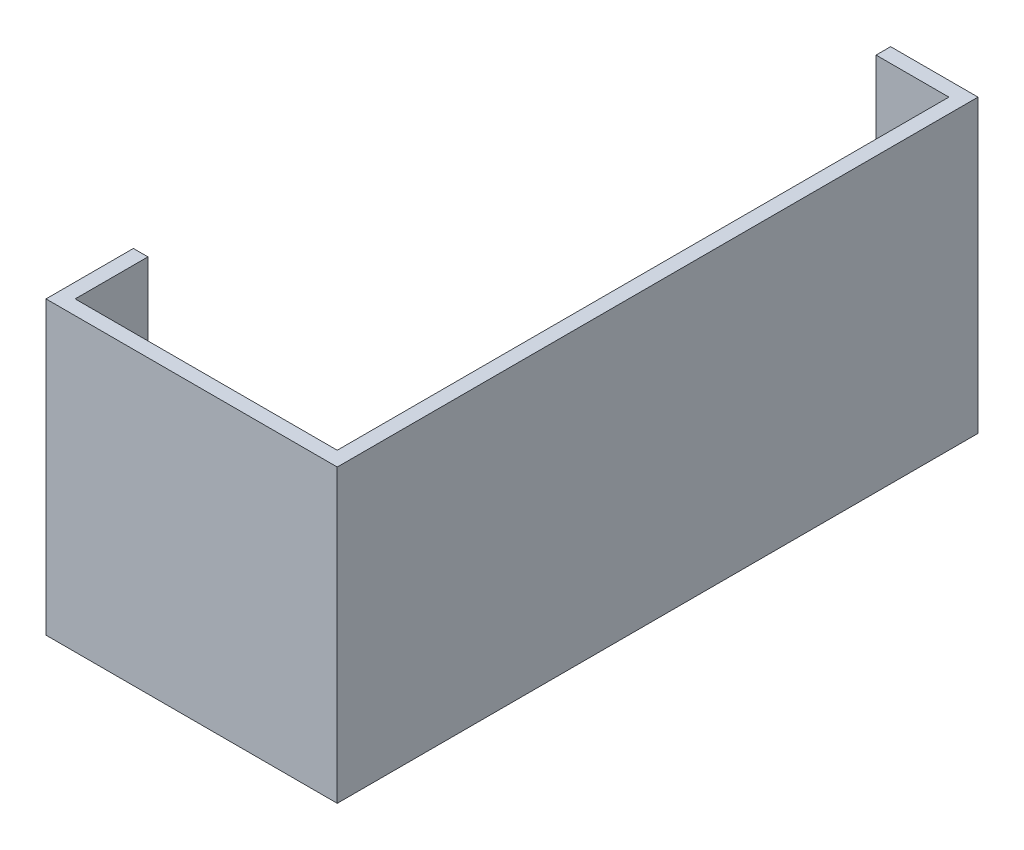
ISO-10303-21;
HEADER;
FILE_DESCRIPTION(('STEP AP214'),'2;1');
FILE_NAME('part.step','',(''),(''),'','','');
FILE_SCHEMA(('AUTOMOTIVE_DESIGN { 1 0 10303 214 1 1 1 1 }'));
ENDSEC;
DATA;
#1=APPLICATION_CONTEXT('core data for automotive mechanical design processes');
#2=APPLICATION_PROTOCOL_DEFINITION('international standard','automotive_design',2000,#1);
#3=PRODUCT_CONTEXT('',#1,'mechanical');
#4=PRODUCT('Part','Part','',(#3));
#5=PRODUCT_RELATED_PRODUCT_CATEGORY('part','',(#4));
#6=PRODUCT_DEFINITION_FORMATION('','',#4);
#7=PRODUCT_DEFINITION_CONTEXT('part definition',#1,'design');
#8=PRODUCT_DEFINITION('design','',#6,#7);
#9=PRODUCT_DEFINITION_SHAPE('','',#8);
#10=(LENGTH_UNIT() NAMED_UNIT(*) SI_UNIT(.MILLI.,.METRE.));
#11=(NAMED_UNIT(*) PLANE_ANGLE_UNIT() SI_UNIT($,.RADIAN.));
#12=(NAMED_UNIT(*) SI_UNIT($,.STERADIAN.) SOLID_ANGLE_UNIT());
#13=UNCERTAINTY_MEASURE_WITH_UNIT(LENGTH_MEASURE(1.E-05),#10,'distance_accuracy_value','');
#14=(GEOMETRIC_REPRESENTATION_CONTEXT(3) GLOBAL_UNCERTAINTY_ASSIGNED_CONTEXT((#13)) GLOBAL_UNIT_ASSIGNED_CONTEXT((#10,
#11,#12)) REPRESENTATION_CONTEXT('',''));
#15=CARTESIAN_POINT('',(0.,0.,0.));
#16=DIRECTION('',(0.,0.,1.));
#17=DIRECTION('',(1.,0.,0.));
#18=AXIS2_PLACEMENT_3D('',#15,#16,#17);
#19=CARTESIAN_POINT('',(-5.,100.,-215.));
#20=DIRECTION('',(0.,0.,-1.));
#21=DIRECTION('',(-1.,0.,0.));
#22=AXIS2_PLACEMENT_3D('',#19,#20,#21);
#23=PLANE('',#22);
#24=DIRECTION('',(1.,0.,0.));
#25=VECTOR('',#24,1.);
#26=CARTESIAN_POINT('',(-30.,3.,-215.));
#27=LINE('',#26,#25);
#28=CARTESIAN_POINT('',(-30.,3.,-215.));
#29=VERTEX_POINT('',#28);
#30=CARTESIAN_POINT('',(-5.,3.,-215.));
#31=VERTEX_POINT('',#30);
#32=EDGE_CURVE('E57',#29,#31,#27,.T.);
#33=ORIENTED_EDGE('',*,*,#32,.T.);
#34=DIRECTION('',(0.,-1.,0.));
#35=VECTOR('',#34,1.);
#36=CARTESIAN_POINT('',(-5.,100.,-215.));
#37=LINE('',#36,#35);
#38=CARTESIAN_POINT('',(-5.,100.,-215.));
#39=VERTEX_POINT('',#38);
#40=EDGE_CURVE('E169',#39,#31,#37,.T.);
#41=ORIENTED_EDGE('',*,*,#40,.F.);
#42=DIRECTION('',(1.,0.,0.));
#43=VECTOR('',#42,1.);
#44=CARTESIAN_POINT('',(-5.,100.,-215.));
#45=LINE('',#44,#43);
#46=CARTESIAN_POINT('',(-30.,100.,-215.));
#47=VERTEX_POINT('',#46);
#48=EDGE_CURVE('E194',#47,#39,#45,.T.);
#49=ORIENTED_EDGE('',*,*,#48,.F.);
#50=DIRECTION('',(0.,-1.,0.));
#51=VECTOR('',#50,1.);
#52=CARTESIAN_POINT('',(-30.,100.,-215.));
#53=LINE('',#52,#51);
#54=EDGE_CURVE('E171',#47,#29,#53,.T.);
#55=ORIENTED_EDGE('',*,*,#54,.T.);
#56=EDGE_LOOP('',(#33,#41,#49,#55));
#57=FACE_BOUND('',#56,.T.);
#58=ADVANCED_FACE('F35',(#57),#23,.F.);
#59=CARTESIAN_POINT('',(-5.,100.,-5.));
#60=DIRECTION('',(1.,0.,0.));
#61=DIRECTION('',(0.,0.,-1.));
#62=AXIS2_PLACEMENT_3D('',#59,#60,#61);
#63=PLANE('',#62);
#64=DIRECTION('',(0.,0.,1.));
#65=VECTOR('',#64,1.);
#66=CARTESIAN_POINT('',(-5.,3.,-215.));
#67=LINE('',#66,#65);
#68=CARTESIAN_POINT('',(-5.,3.,-5.));
#69=VERTEX_POINT('',#68);
#70=EDGE_CURVE('E229',#31,#69,#67,.T.);
#71=ORIENTED_EDGE('',*,*,#70,.T.);
#72=DIRECTION('',(0.,-1.,0.));
#73=VECTOR('',#72,1.);
#74=CARTESIAN_POINT('',(-5.,100.,-5.));
#75=LINE('',#74,#73);
#76=CARTESIAN_POINT('',(-5.,100.,-5.));
#77=VERTEX_POINT('',#76);
#78=EDGE_CURVE('E166',#77,#69,#75,.T.);
#79=ORIENTED_EDGE('',*,*,#78,.F.);
#80=DIRECTION('',(0.,0.,1.));
#81=VECTOR('',#80,1.);
#82=CARTESIAN_POINT('',(-5.,100.,-5.));
#83=LINE('',#82,#81);
#84=EDGE_CURVE('E197',#39,#77,#83,.T.);
#85=ORIENTED_EDGE('',*,*,#84,.F.);
#86=ORIENTED_EDGE('',*,*,#40,.T.);
#87=EDGE_LOOP('',(#71,#79,#85,#86));
#88=FACE_BOUND('',#87,.T.);
#89=ADVANCED_FACE('F237',(#88),#63,.F.);
#90=CARTESIAN_POINT('',(-95.,100.,-5.));
#91=DIRECTION('',(0.,0.,1.));
#92=DIRECTION('',(1.,0.,0.));
#93=AXIS2_PLACEMENT_3D('',#90,#91,#92);
#94=PLANE('',#93);
#95=DIRECTION('',(-1.,0.,0.));
#96=VECTOR('',#95,1.);
#97=CARTESIAN_POINT('',(-5.,3.,-5.));
#98=LINE('',#97,#96);
#99=CARTESIAN_POINT('',(-95.,3.,-5.));
#100=VERTEX_POINT('',#99);
#101=EDGE_CURVE('E228',#69,#100,#98,.T.);
#102=ORIENTED_EDGE('',*,*,#101,.T.);
#103=DIRECTION('',(0.,-1.,0.));
#104=VECTOR('',#103,1.);
#105=CARTESIAN_POINT('',(-95.,100.,-5.));
#106=LINE('',#105,#104);
#107=CARTESIAN_POINT('',(-95.,100.,-5.));
#108=VERTEX_POINT('',#107);
#109=EDGE_CURVE('E163',#108,#100,#106,.T.);
#110=ORIENTED_EDGE('',*,*,#109,.F.);
#111=DIRECTION('',(-1.,0.,0.));
#112=VECTOR('',#111,1.);
#113=CARTESIAN_POINT('',(-95.,100.,-5.));
#114=LINE('',#113,#112);
#115=EDGE_CURVE('E203',#77,#108,#114,.T.);
#116=ORIENTED_EDGE('',*,*,#115,.F.);
#117=ORIENTED_EDGE('',*,*,#78,.T.);
#118=EDGE_LOOP('',(#102,#110,#116,#117));
#119=FACE_BOUND('',#118,.T.);
#120=ADVANCED_FACE('F240',(#119),#94,.F.);
#121=CARTESIAN_POINT('',(-95.,100.,-5.));
#122=DIRECTION('',(-1.,0.,0.));
#123=DIRECTION('',(0.,0.,1.));
#124=AXIS2_PLACEMENT_3D('',#121,#122,#123);
#125=PLANE('',#124);
#126=DIRECTION('',(0.,0.,-1.));
#127=VECTOR('',#126,1.);
#128=CARTESIAN_POINT('',(-95.,3.,-5.));
#129=LINE('',#128,#127);
#130=CARTESIAN_POINT('',(-95.,3.,-30.));
#131=VERTEX_POINT('',#130);
#132=EDGE_CURVE('E212',#100,#131,#129,.T.);
#133=ORIENTED_EDGE('',*,*,#132,.T.);
#134=DIRECTION('',(0.,-1.,0.));
#135=VECTOR('',#134,1.);
#136=CARTESIAN_POINT('',(-95.,100.,-30.));
#137=LINE('',#136,#135);
#138=CARTESIAN_POINT('',(-95.,100.,-30.));
#139=VERTEX_POINT('',#138);
#140=EDGE_CURVE('E160',#139,#131,#137,.T.);
#141=ORIENTED_EDGE('',*,*,#140,.F.);
#142=DIRECTION('',(0.,0.,-1.));
#143=VECTOR('',#142,1.);
#144=CARTESIAN_POINT('',(-95.,100.,-5.));
#145=LINE('',#144,#143);
#146=EDGE_CURVE('E204',#108,#139,#145,.T.);
#147=ORIENTED_EDGE('',*,*,#146,.F.);
#148=ORIENTED_EDGE('',*,*,#109,.T.);
#149=EDGE_LOOP('',(#133,#141,#147,#148));
#150=FACE_BOUND('',#149,.T.);
#151=ADVANCED_FACE('F210',(#150),#125,.F.);
#152=CARTESIAN_POINT('',(-100.,100.,0.));
#153=DIRECTION('',(1.,0.,0.));
#154=DIRECTION('',(0.,0.,-1.));
#155=AXIS2_PLACEMENT_3D('',#152,#153,#154);
#156=PLANE('',#155);
#157=DIRECTION('',(0.,0.,1.));
#158=VECTOR('',#157,1.);
#159=CARTESIAN_POINT('',(-100.,0.,0.));
#160=LINE('',#159,#158);
#161=CARTESIAN_POINT('',(-100.,0.,-30.));
#162=VERTEX_POINT('',#161);
#163=CARTESIAN_POINT('',(-100.,0.,0.));
#164=VERTEX_POINT('',#163);
#165=EDGE_CURVE('E140',#162,#164,#160,.T.);
#166=ORIENTED_EDGE('',*,*,#165,.T.);
#167=DIRECTION('',(0.,-1.,0.));
#168=VECTOR('',#167,1.);
#169=CARTESIAN_POINT('',(-100.,100.,0.));
#170=LINE('',#169,#168);
#171=CARTESIAN_POINT('',(-100.,100.,0.));
#172=VERTEX_POINT('',#171);
#173=EDGE_CURVE('E11',#172,#164,#170,.T.);
#174=ORIENTED_EDGE('',*,*,#173,.F.);
#175=DIRECTION('',(0.,0.,1.));
#176=VECTOR('',#175,1.);
#177=CARTESIAN_POINT('',(-100.,100.,0.));
#178=LINE('',#177,#176);
#179=CARTESIAN_POINT('',(-100.,100.,-30.));
#180=VERTEX_POINT('',#179);
#181=EDGE_CURVE('E128',#180,#172,#178,.T.);
#182=ORIENTED_EDGE('',*,*,#181,.F.);
#183=DIRECTION('',(0.,-1.,0.));
#184=VECTOR('',#183,1.);
#185=CARTESIAN_POINT('',(-100.,100.,-30.));
#186=LINE('',#185,#184);
#187=EDGE_CURVE('E141',#180,#162,#186,.T.);
#188=ORIENTED_EDGE('',*,*,#187,.T.);
#189=EDGE_LOOP('',(#166,#174,#182,#188));
#190=FACE_BOUND('',#189,.T.);
#191=ADVANCED_FACE('F37',(#190),#156,.F.);
#192=CARTESIAN_POINT('',(-100.,100.,0.));
#193=DIRECTION('',(0.,0.,-1.));
#194=DIRECTION('',(-1.,0.,0.));
#195=AXIS2_PLACEMENT_3D('',#192,#193,#194);
#196=PLANE('',#195);
#197=DIRECTION('',(1.,0.,0.));
#198=VECTOR('',#197,1.);
#199=CARTESIAN_POINT('',(-100.,0.,0.));
#200=LINE('',#199,#198);
#201=CARTESIAN_POINT('',(0.,0.,0.));
#202=VERTEX_POINT('',#201);
#203=EDGE_CURVE('E144',#164,#202,#200,.T.);
#204=ORIENTED_EDGE('',*,*,#203,.T.);
#205=DIRECTION('',(0.,-1.,0.));
#206=VECTOR('',#205,1.);
#207=CARTESIAN_POINT('',(0.,100.,0.));
#208=LINE('',#207,#206);
#209=CARTESIAN_POINT('',(0.,100.,0.));
#210=VERTEX_POINT('',#209);
#211=EDGE_CURVE('E43',#210,#202,#208,.T.);
#212=ORIENTED_EDGE('',*,*,#211,.F.);
#213=DIRECTION('',(1.,0.,0.));
#214=VECTOR('',#213,1.);
#215=CARTESIAN_POINT('',(-100.,100.,0.));
#216=LINE('',#215,#214);
#217=EDGE_CURVE('E119',#172,#210,#216,.T.);
#218=ORIENTED_EDGE('',*,*,#217,.F.);
#219=ORIENTED_EDGE('',*,*,#173,.T.);
#220=EDGE_LOOP('',(#204,#212,#218,#219));
#221=FACE_BOUND('',#220,.T.);
#222=ADVANCED_FACE('F121',(#221),#196,.F.);
#223=CARTESIAN_POINT('',(0.,100.,0.));
#224=DIRECTION('',(-1.,0.,0.));
#225=DIRECTION('',(0.,0.,1.));
#226=AXIS2_PLACEMENT_3D('',#223,#224,#225);
#227=PLANE('',#226);
#228=DIRECTION('',(0.,0.,-1.));
#229=VECTOR('',#228,1.);
#230=CARTESIAN_POINT('',(0.,0.,0.));
#231=LINE('',#230,#229);
#232=CARTESIAN_POINT('',(0.,0.,-220.));
#233=VERTEX_POINT('',#232);
#234=EDGE_CURVE('E147',#202,#233,#231,.T.);
#235=ORIENTED_EDGE('',*,*,#234,.T.);
#236=DIRECTION('',(0.,-1.,0.));
#237=VECTOR('',#236,1.);
#238=CARTESIAN_POINT('',(0.,100.,-220.));
#239=LINE('',#238,#237);
#240=CARTESIAN_POINT('',(0.,100.,-220.));
#241=VERTEX_POINT('',#240);
#242=EDGE_CURVE('E176',#241,#233,#239,.T.);
#243=ORIENTED_EDGE('',*,*,#242,.F.);
#244=DIRECTION('',(0.,0.,-1.));
#245=VECTOR('',#244,1.);
#246=CARTESIAN_POINT('',(0.,100.,0.));
#247=LINE('',#246,#245);
#248=EDGE_CURVE('E127',#210,#241,#247,.T.);
#249=ORIENTED_EDGE('',*,*,#248,.F.);
#250=ORIENTED_EDGE('',*,*,#211,.T.);
#251=EDGE_LOOP('',(#235,#243,#249,#250));
#252=FACE_BOUND('',#251,.T.);
#253=ADVANCED_FACE('F180',(#252),#227,.F.);
#254=CARTESIAN_POINT('',(0.,100.,-220.));
#255=DIRECTION('',(0.,0.,1.));
#256=DIRECTION('',(1.,0.,0.));
#257=AXIS2_PLACEMENT_3D('',#254,#255,#256);
#258=PLANE('',#257);
#259=DIRECTION('',(-1.,0.,0.));
#260=VECTOR('',#259,1.);
#261=CARTESIAN_POINT('',(0.,0.,-220.));
#262=LINE('',#261,#260);
#263=CARTESIAN_POINT('',(-30.,0.,-220.));
#264=VERTEX_POINT('',#263);
#265=EDGE_CURVE('E154',#233,#264,#262,.T.);
#266=ORIENTED_EDGE('',*,*,#265,.T.);
#267=DIRECTION('',(0.,-1.,0.));
#268=VECTOR('',#267,1.);
#269=CARTESIAN_POINT('',(-30.,100.,-220.));
#270=LINE('',#269,#268);
#271=CARTESIAN_POINT('',(-30.,100.,-220.));
#272=VERTEX_POINT('',#271);
#273=EDGE_CURVE('E173',#272,#264,#270,.T.);
#274=ORIENTED_EDGE('',*,*,#273,.F.);
#275=DIRECTION('',(-1.,0.,0.));
#276=VECTOR('',#275,1.);
#277=CARTESIAN_POINT('',(0.,100.,-220.));
#278=LINE('',#277,#276);
#279=EDGE_CURVE('E195',#241,#272,#278,.T.);
#280=ORIENTED_EDGE('',*,*,#279,.F.);
#281=ORIENTED_EDGE('',*,*,#242,.T.);
#282=EDGE_LOOP('',(#266,#274,#280,#281));
#283=FACE_BOUND('',#282,.T.);
#284=ADVANCED_FACE('F188',(#283),#258,.F.);
#285=CARTESIAN_POINT('',(-30.,100.,-220.));
#286=DIRECTION('',(1.,0.,0.));
#287=DIRECTION('',(0.,0.,-1.));
#288=AXIS2_PLACEMENT_3D('',#285,#286,#287);
#289=PLANE('',#288);
#290=DIRECTION('',(0.,0.,1.));
#291=VECTOR('',#290,1.);
#292=CARTESIAN_POINT('',(-30.,0.,-220.));
#293=LINE('',#292,#291);
#294=CARTESIAN_POINT('',(-30.,0.,-215.));
#295=VERTEX_POINT('',#294);
#296=EDGE_CURVE('E156',#264,#295,#293,.T.);
#297=ORIENTED_EDGE('',*,*,#296,.T.);
#298=DIRECTION('',(0.,-1.,0.));
#299=VECTOR('',#298,1.);
#300=CARTESIAN_POINT('',(-30.,3.,-215.));
#301=LINE('',#300,#299);
#302=EDGE_CURVE('E50',#29,#295,#301,.T.);
#303=ORIENTED_EDGE('',*,*,#302,.F.);
#304=ORIENTED_EDGE('',*,*,#54,.F.);
#305=DIRECTION('',(0.,0.,1.));
#306=VECTOR('',#305,1.);
#307=CARTESIAN_POINT('',(-30.,100.,-220.));
#308=LINE('',#307,#306);
#309=EDGE_CURVE('E192',#272,#47,#308,.T.);
#310=ORIENTED_EDGE('',*,*,#309,.F.);
#311=ORIENTED_EDGE('',*,*,#273,.T.);
#312=EDGE_LOOP('',(#297,#303,#304,#310,#311));
#313=FACE_BOUND('',#312,.T.);
#314=ADVANCED_FACE('F191',(#313),#289,.F.);
#315=CARTESIAN_POINT('',(-100.,100.,-30.));
#316=DIRECTION('',(0.,0.,1.));
#317=DIRECTION('',(1.,0.,0.));
#318=AXIS2_PLACEMENT_3D('',#315,#316,#317);
#319=PLANE('',#318);
#320=DIRECTION('',(-1.,0.,0.));
#321=VECTOR('',#320,1.);
#322=CARTESIAN_POINT('',(-100.,0.,-30.));
#323=LINE('',#322,#321);
#324=CARTESIAN_POINT('',(-95.,0.,-30.));
#325=VERTEX_POINT('',#324);
#326=EDGE_CURVE('E137',#325,#162,#323,.T.);
#327=ORIENTED_EDGE('',*,*,#326,.T.);
#328=ORIENTED_EDGE('',*,*,#187,.F.);
#329=DIRECTION('',(-1.,0.,0.));
#330=VECTOR('',#329,1.);
#331=CARTESIAN_POINT('',(-100.,100.,-30.));
#332=LINE('',#331,#330);
#333=EDGE_CURVE('E133',#139,#180,#332,.T.);
#334=ORIENTED_EDGE('',*,*,#333,.F.);
#335=ORIENTED_EDGE('',*,*,#140,.T.);
#336=DIRECTION('',(0.,-1.,0.));
#337=VECTOR('',#336,1.);
#338=CARTESIAN_POINT('',(-95.,3.,-30.));
#339=LINE('',#338,#337);
#340=EDGE_CURVE('E145',#131,#325,#339,.T.);
#341=ORIENTED_EDGE('',*,*,#340,.T.);
#342=EDGE_LOOP('',(#327,#328,#334,#335,#341));
#343=FACE_BOUND('',#342,.T.);
#344=ADVANCED_FACE('F215',(#343),#319,.F.);
#345=CARTESIAN_POINT('',(0.,100.,0.));
#346=DIRECTION('',(0.,-1.,0.));
#347=DIRECTION('',(0.,0.,-1.));
#348=AXIS2_PLACEMENT_3D('',#345,#346,#347);
#349=PLANE('',#348);
#350=ORIENTED_EDGE('',*,*,#181,.T.);
#351=ORIENTED_EDGE('',*,*,#217,.T.);
#352=ORIENTED_EDGE('',*,*,#248,.T.);
#353=ORIENTED_EDGE('',*,*,#279,.T.);
#354=ORIENTED_EDGE('',*,*,#309,.T.);
#355=ORIENTED_EDGE('',*,*,#48,.T.);
#356=ORIENTED_EDGE('',*,*,#84,.T.);
#357=ORIENTED_EDGE('',*,*,#115,.T.);
#358=ORIENTED_EDGE('',*,*,#146,.T.);
#359=ORIENTED_EDGE('',*,*,#333,.T.);
#360=EDGE_LOOP('',(#350,#351,#352,#353,#354,#355,#356,#357,#358,#359));
#361=FACE_BOUND('',#360,.T.);
#362=ADVANCED_FACE('F131',(#361),#349,.F.);
#363=CARTESIAN_POINT('',(0.,0.,0.));
#364=DIRECTION('',(0.,-1.,0.));
#365=DIRECTION('',(0.,0.,-1.));
#366=AXIS2_PLACEMENT_3D('',#363,#364,#365);
#367=PLANE('',#366);
#368=ORIENTED_EDGE('',*,*,#326,.F.);
#369=DIRECTION('',(0.33148599501256,0.,-0.943460139651132));
#370=VECTOR('',#369,1.);
#371=CARTESIAN_POINT('',(-95.,0.,-30.));
#372=LINE('',#371,#370);
#373=EDGE_CURVE('E217',#325,#295,#372,.T.);
#374=ORIENTED_EDGE('',*,*,#373,.T.);
#375=ORIENTED_EDGE('',*,*,#296,.F.);
#376=ORIENTED_EDGE('',*,*,#265,.F.);
#377=ORIENTED_EDGE('',*,*,#234,.F.);
#378=ORIENTED_EDGE('',*,*,#203,.F.);
#379=ORIENTED_EDGE('',*,*,#165,.F.);
#380=EDGE_LOOP('',(#368,#374,#375,#376,#377,#378,#379));
#381=FACE_BOUND('',#380,.T.);
#382=ADVANCED_FACE('F183',(#381),#367,.T.);
#383=CARTESIAN_POINT('',(-95.,3.,-30.));
#384=DIRECTION('',(-0.943460139651132,0.,-0.33148599501256));
#385=DIRECTION('',(-0.33148599501256,0.,0.943460139651132));
#386=AXIS2_PLACEMENT_3D('',#383,#384,#385);
#387=PLANE('',#386);
#388=ORIENTED_EDGE('',*,*,#373,.F.);
#389=ORIENTED_EDGE('',*,*,#340,.F.);
#390=DIRECTION('',(0.33148599501256,0.,-0.943460139651132));
#391=VECTOR('',#390,1.);
#392=CARTESIAN_POINT('',(-95.,3.,-30.));
#393=LINE('',#392,#391);
#394=EDGE_CURVE('E222',#131,#29,#393,.T.);
#395=ORIENTED_EDGE('',*,*,#394,.T.);
#396=ORIENTED_EDGE('',*,*,#302,.T.);
#397=EDGE_LOOP('',(#388,#389,#395,#396));
#398=FACE_BOUND('',#397,.T.);
#399=ADVANCED_FACE('F219',(#398),#387,.T.);
#400=CARTESIAN_POINT('',(0.,3.,0.));
#401=DIRECTION('',(0.,-1.,0.));
#402=DIRECTION('',(0.,0.,-1.));
#403=AXIS2_PLACEMENT_3D('',#400,#401,#402);
#404=PLANE('',#403);
#405=ORIENTED_EDGE('',*,*,#394,.F.);
#406=ORIENTED_EDGE('',*,*,#132,.F.);
#407=ORIENTED_EDGE('',*,*,#101,.F.);
#408=ORIENTED_EDGE('',*,*,#70,.F.);
#409=ORIENTED_EDGE('',*,*,#32,.F.);
#410=EDGE_LOOP('',(#405,#406,#407,#408,#409));
#411=FACE_BOUND('',#410,.T.);
#412=ADVANCED_FACE('F241',(#411),#404,.F.);
#413=CLOSED_SHELL('',(#58,#89,#120,#151,#191,#222,#253,#284,#314,#344,#362,#382,#399,#412));
#414=MANIFOLD_SOLID_BREP('B2',#413);
#415=ADVANCED_BREP_SHAPE_REPRESENTATION('',(#18,#414),#14);
#416=SHAPE_DEFINITION_REPRESENTATION(#9,#415);
ENDSEC;
END-ISO-10303-21;
